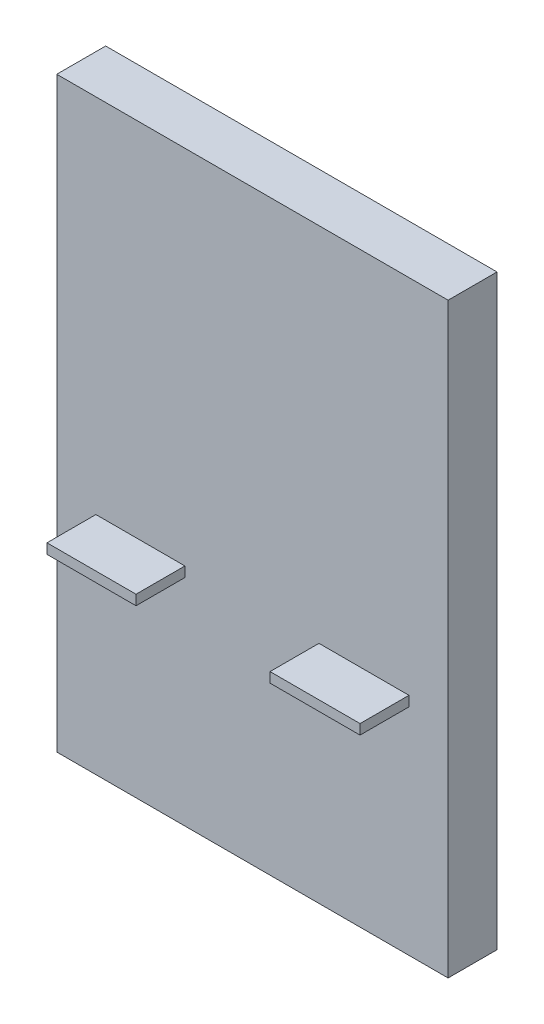
ISO-10303-21;
HEADER;
FILE_DESCRIPTION(('STEP AP214'),'2;1');
FILE_NAME('part.step','',(''),(''),'','','');
FILE_SCHEMA(('AUTOMOTIVE_DESIGN { 1 0 10303 214 1 1 1 1 }'));
ENDSEC;
DATA;
#1=APPLICATION_CONTEXT('core data for automotive mechanical design processes');
#2=APPLICATION_PROTOCOL_DEFINITION('international standard','automotive_design',2000,#1);
#3=PRODUCT_CONTEXT('',#1,'mechanical');
#4=PRODUCT('Part','Part','',(#3));
#5=PRODUCT_RELATED_PRODUCT_CATEGORY('part','',(#4));
#6=PRODUCT_DEFINITION_FORMATION('','',#4);
#7=PRODUCT_DEFINITION_CONTEXT('part definition',#1,'design');
#8=PRODUCT_DEFINITION('design','',#6,#7);
#9=PRODUCT_DEFINITION_SHAPE('','',#8);
#10=(LENGTH_UNIT() NAMED_UNIT(*) SI_UNIT(.MILLI.,.METRE.));
#11=(NAMED_UNIT(*) PLANE_ANGLE_UNIT() SI_UNIT($,.RADIAN.));
#12=(NAMED_UNIT(*) SI_UNIT($,.STERADIAN.) SOLID_ANGLE_UNIT());
#13=UNCERTAINTY_MEASURE_WITH_UNIT(LENGTH_MEASURE(1.E-05),#10,'distance_accuracy_value','');
#14=(GEOMETRIC_REPRESENTATION_CONTEXT(3) GLOBAL_UNCERTAINTY_ASSIGNED_CONTEXT((#13)) GLOBAL_UNIT_ASSIGNED_CONTEXT((#10,
#11,#12)) REPRESENTATION_CONTEXT('',''));
#15=CARTESIAN_POINT('',(0.,0.,0.));
#16=DIRECTION('',(0.,0.,1.));
#17=DIRECTION('',(1.,0.,0.));
#18=AXIS2_PLACEMENT_3D('',#15,#16,#17);
#19=CARTESIAN_POINT('',(0.,0.,0.));
#20=DIRECTION('',(0.,0.,-1.));
#21=DIRECTION('',(-1.,0.,0.));
#22=AXIS2_PLACEMENT_3D('',#19,#20,#21);
#23=PLANE('',#22);
#24=DIRECTION('',(0.,-1.,0.));
#25=VECTOR('',#24,1.);
#26=CARTESIAN_POINT('',(-0.8,1.1,0.));
#27=LINE('',#26,#25);
#28=CARTESIAN_POINT('',(-0.8,1.15119353143523,0.));
#29=VERTEX_POINT('',#28);
#30=CARTESIAN_POINT('',(-0.8,1.1,0.));
#31=VERTEX_POINT('',#30);
#32=EDGE_CURVE('E154',#29,#31,#27,.T.);
#33=ORIENTED_EDGE('',*,*,#32,.F.);
#34=DIRECTION('',(-1.,0.,0.));
#35=VECTOR('',#34,1.);
#36=CARTESIAN_POINT('',(-0.8,1.15119353143523,0.));
#37=LINE('',#36,#35);
#38=CARTESIAN_POINT('',(-0.344987373897849,1.15119353143523,0.));
#39=VERTEX_POINT('',#38);
#40=EDGE_CURVE('E170',#39,#29,#37,.T.);
#41=ORIENTED_EDGE('',*,*,#40,.F.);
#42=DIRECTION('',(0.,1.,0.));
#43=VECTOR('',#42,1.);
#44=CARTESIAN_POINT('',(-0.344987373897849,1.1,0.));
#45=LINE('',#44,#43);
#46=CARTESIAN_POINT('',(-0.344987373897849,1.1,0.));
#47=VERTEX_POINT('',#46);
#48=EDGE_CURVE('E183',#47,#39,#45,.T.);
#49=ORIENTED_EDGE('',*,*,#48,.F.);
#50=DIRECTION('',(1.,0.,0.));
#51=VECTOR('',#50,1.);
#52=CARTESIAN_POINT('',(-0.8,1.1,0.));
#53=LINE('',#52,#51);
#54=EDGE_CURVE('E159',#31,#47,#53,.T.);
#55=ORIENTED_EDGE('',*,*,#54,.F.);
#56=EDGE_LOOP('',(#33,#41,#49,#55));
#57=FACE_BOUND('',#56,.T.);
#58=DIRECTION('',(0.,-1.,0.));
#59=VECTOR('',#58,1.);
#60=CARTESIAN_POINT('',(-1.,0.,0.));
#61=LINE('',#60,#59);
#62=CARTESIAN_POINT('',(-1.,3.,0.));
#63=VERTEX_POINT('',#62);
#64=CARTESIAN_POINT('',(-1.,0.,0.));
#65=VERTEX_POINT('',#64);
#66=EDGE_CURVE('E205',#63,#65,#61,.T.);
#67=ORIENTED_EDGE('',*,*,#66,.T.);
#68=DIRECTION('',(1.,0.,0.));
#69=VECTOR('',#68,1.);
#70=CARTESIAN_POINT('',(-1.,0.,0.));
#71=LINE('',#70,#69);
#72=CARTESIAN_POINT('',(1.,0.,0.));
#73=VERTEX_POINT('',#72);
#74=EDGE_CURVE('E226',#65,#73,#71,.T.);
#75=ORIENTED_EDGE('',*,*,#74,.T.);
#76=DIRECTION('',(0.,1.,0.));
#77=VECTOR('',#76,1.);
#78=CARTESIAN_POINT('',(1.,0.,0.));
#79=LINE('',#78,#77);
#80=CARTESIAN_POINT('',(1.,3.,0.));
#81=VERTEX_POINT('',#80);
#82=EDGE_CURVE('E230',#73,#81,#79,.T.);
#83=ORIENTED_EDGE('',*,*,#82,.T.);
#84=DIRECTION('',(-1.,0.,0.));
#85=VECTOR('',#84,1.);
#86=CARTESIAN_POINT('',(-1.,3.,0.));
#87=LINE('',#86,#85);
#88=EDGE_CURVE('E211',#81,#63,#87,.T.);
#89=ORIENTED_EDGE('',*,*,#88,.T.);
#90=EDGE_LOOP('',(#67,#75,#83,#89));
#91=FACE_BOUND('',#90,.T.);
#92=DIRECTION('',(0.,-1.,0.));
#93=VECTOR('',#92,1.);
#94=CARTESIAN_POINT('',(0.34,1.15119353143523,0.));
#95=LINE('',#94,#93);
#96=CARTESIAN_POINT('',(0.34,1.15119353143523,0.));
#97=VERTEX_POINT('',#96);
#98=CARTESIAN_POINT('',(0.34,1.1,0.));
#99=VERTEX_POINT('',#98);
#100=EDGE_CURVE('E152',#97,#99,#95,.T.);
#101=ORIENTED_EDGE('',*,*,#100,.F.);
#102=DIRECTION('',(-1.,0.,0.));
#103=VECTOR('',#102,1.);
#104=CARTESIAN_POINT('',(0.34,1.15119353143523,0.));
#105=LINE('',#104,#103);
#106=CARTESIAN_POINT('',(0.8,1.15119353143523,0.));
#107=VERTEX_POINT('',#106);
#108=EDGE_CURVE('E149',#107,#97,#105,.T.);
#109=ORIENTED_EDGE('',*,*,#108,.F.);
#110=DIRECTION('',(0.,1.,0.));
#111=VECTOR('',#110,1.);
#112=CARTESIAN_POINT('',(0.8,1.15119353143523,0.));
#113=LINE('',#112,#111);
#114=CARTESIAN_POINT('',(0.8,1.1,0.));
#115=VERTEX_POINT('',#114);
#116=EDGE_CURVE('E62',#115,#107,#113,.T.);
#117=ORIENTED_EDGE('',*,*,#116,.F.);
#118=DIRECTION('',(1.,0.,0.));
#119=VECTOR('',#118,1.);
#120=CARTESIAN_POINT('',(0.34,1.1,0.));
#121=LINE('',#120,#119);
#122=EDGE_CURVE('E57',#99,#115,#121,.T.);
#123=ORIENTED_EDGE('',*,*,#122,.F.);
#124=EDGE_LOOP('',(#101,#109,#117,#123));
#125=FACE_BOUND('',#124,.T.);
#126=ADVANCED_FACE('F39',(#57,#91,#125),#23,.F.);
#127=CARTESIAN_POINT('',(-1.,0.,-0.25));
#128=DIRECTION('',(-1.,0.,0.));
#129=DIRECTION('',(0.,0.,1.));
#130=AXIS2_PLACEMENT_3D('',#127,#128,#129);
#131=PLANE('',#130);
#132=ORIENTED_EDGE('',*,*,#66,.F.);
#133=DIRECTION('',(0.,0.,1.));
#134=VECTOR('',#133,1.);
#135=CARTESIAN_POINT('',(-1.,3.,-0.25));
#136=LINE('',#135,#134);
#137=CARTESIAN_POINT('',(-1.,3.,-0.25));
#138=VERTEX_POINT('',#137);
#139=EDGE_CURVE('E11',#138,#63,#136,.T.);
#140=ORIENTED_EDGE('',*,*,#139,.F.);
#141=DIRECTION('',(0.,-1.,0.));
#142=VECTOR('',#141,1.);
#143=CARTESIAN_POINT('',(-1.,0.,-0.25));
#144=LINE('',#143,#142);
#145=CARTESIAN_POINT('',(-1.,0.,-0.25));
#146=VERTEX_POINT('',#145);
#147=EDGE_CURVE('E206',#138,#146,#144,.T.);
#148=ORIENTED_EDGE('',*,*,#147,.T.);
#149=DIRECTION('',(0.,0.,1.));
#150=VECTOR('',#149,1.);
#151=CARTESIAN_POINT('',(-1.,0.,-0.25));
#152=LINE('',#151,#150);
#153=EDGE_CURVE('E43',#146,#65,#152,.T.);
#154=ORIENTED_EDGE('',*,*,#153,.T.);
#155=EDGE_LOOP('',(#132,#140,#148,#154));
#156=FACE_BOUND('',#155,.T.);
#157=ADVANCED_FACE('F41',(#156),#131,.T.);
#158=CARTESIAN_POINT('',(-1.,3.,-0.25));
#159=DIRECTION('',(0.,1.,0.));
#160=DIRECTION('',(0.,0.,1.));
#161=AXIS2_PLACEMENT_3D('',#158,#159,#160);
#162=PLANE('',#161);
#163=ORIENTED_EDGE('',*,*,#88,.F.);
#164=DIRECTION('',(0.,0.,1.));
#165=VECTOR('',#164,1.);
#166=CARTESIAN_POINT('',(1.,3.,-0.25));
#167=LINE('',#166,#165);
#168=CARTESIAN_POINT('',(1.,3.,-0.25));
#169=VERTEX_POINT('',#168);
#170=EDGE_CURVE('E49',#169,#81,#167,.T.);
#171=ORIENTED_EDGE('',*,*,#170,.F.);
#172=DIRECTION('',(-1.,0.,0.));
#173=VECTOR('',#172,1.);
#174=CARTESIAN_POINT('',(-1.,3.,-0.25));
#175=LINE('',#174,#173);
#176=EDGE_CURVE('E219',#169,#138,#175,.T.);
#177=ORIENTED_EDGE('',*,*,#176,.T.);
#178=ORIENTED_EDGE('',*,*,#139,.T.);
#179=EDGE_LOOP('',(#163,#171,#177,#178));
#180=FACE_BOUND('',#179,.T.);
#181=ADVANCED_FACE('F252',(#180),#162,.T.);
#182=CARTESIAN_POINT('',(1.,0.,-0.25));
#183=DIRECTION('',(1.,0.,0.));
#184=DIRECTION('',(0.,0.,-1.));
#185=AXIS2_PLACEMENT_3D('',#182,#183,#184);
#186=PLANE('',#185);
#187=ORIENTED_EDGE('',*,*,#82,.F.);
#188=DIRECTION('',(0.,0.,1.));
#189=VECTOR('',#188,1.);
#190=CARTESIAN_POINT('',(1.,0.,-0.25));
#191=LINE('',#190,#189);
#192=CARTESIAN_POINT('',(1.,0.,-0.25));
#193=VERTEX_POINT('',#192);
#194=EDGE_CURVE('E238',#193,#73,#191,.T.);
#195=ORIENTED_EDGE('',*,*,#194,.F.);
#196=DIRECTION('',(0.,1.,0.));
#197=VECTOR('',#196,1.);
#198=CARTESIAN_POINT('',(1.,0.,-0.25));
#199=LINE('',#198,#197);
#200=EDGE_CURVE('E215',#193,#169,#199,.T.);
#201=ORIENTED_EDGE('',*,*,#200,.T.);
#202=ORIENTED_EDGE('',*,*,#170,.T.);
#203=EDGE_LOOP('',(#187,#195,#201,#202));
#204=FACE_BOUND('',#203,.T.);
#205=ADVANCED_FACE('F258',(#204),#186,.T.);
#206=CARTESIAN_POINT('',(-1.,0.,-0.25));
#207=DIRECTION('',(0.,-1.,0.));
#208=DIRECTION('',(0.,0.,-1.));
#209=AXIS2_PLACEMENT_3D('',#206,#207,#208);
#210=PLANE('',#209);
#211=ORIENTED_EDGE('',*,*,#74,.F.);
#212=ORIENTED_EDGE('',*,*,#153,.F.);
#213=DIRECTION('',(1.,0.,0.));
#214=VECTOR('',#213,1.);
#215=CARTESIAN_POINT('',(-1.,0.,-0.25));
#216=LINE('',#215,#214);
#217=EDGE_CURVE('E210',#146,#193,#216,.T.);
#218=ORIENTED_EDGE('',*,*,#217,.T.);
#219=ORIENTED_EDGE('',*,*,#194,.T.);
#220=EDGE_LOOP('',(#211,#212,#218,#219));
#221=FACE_BOUND('',#220,.T.);
#222=ADVANCED_FACE('F248',(#221),#210,.T.);
#223=CARTESIAN_POINT('',(0.,0.,-0.25));
#224=DIRECTION('',(0.,0.,-1.));
#225=DIRECTION('',(-1.,0.,0.));
#226=AXIS2_PLACEMENT_3D('',#223,#224,#225);
#227=PLANE('',#226);
#228=ORIENTED_EDGE('',*,*,#147,.F.);
#229=ORIENTED_EDGE('',*,*,#176,.F.);
#230=ORIENTED_EDGE('',*,*,#200,.F.);
#231=ORIENTED_EDGE('',*,*,#217,.F.);
#232=EDGE_LOOP('',(#228,#229,#230,#231));
#233=FACE_BOUND('',#232,.T.);
#234=ADVANCED_FACE('F255',(#233),#227,.T.);
#235=CARTESIAN_POINT('',(-0.8,1.1,0.25));
#236=DIRECTION('',(1.,0.,0.));
#237=DIRECTION('',(0.,0.,-1.));
#238=AXIS2_PLACEMENT_3D('',#235,#236,#237);
#239=PLANE('',#238);
#240=ORIENTED_EDGE('',*,*,#32,.T.);
#241=DIRECTION('',(0.,0.,-1.));
#242=VECTOR('',#241,1.);
#243=CARTESIAN_POINT('',(-0.8,1.1,0.25));
#244=LINE('',#243,#242);
#245=CARTESIAN_POINT('',(-0.8,1.1,0.25));
#246=VERTEX_POINT('',#245);
#247=EDGE_CURVE('E201',#246,#31,#244,.T.);
#248=ORIENTED_EDGE('',*,*,#247,.F.);
#249=DIRECTION('',(0.,-1.,0.));
#250=VECTOR('',#249,1.);
#251=CARTESIAN_POINT('',(-0.8,1.1,0.25));
#252=LINE('',#251,#250);
#253=CARTESIAN_POINT('',(-0.8,1.15119353143523,0.25));
#254=VERTEX_POINT('',#253);
#255=EDGE_CURVE('E165',#254,#246,#252,.T.);
#256=ORIENTED_EDGE('',*,*,#255,.F.);
#257=DIRECTION('',(0.,0.,-1.));
#258=VECTOR('',#257,1.);
#259=CARTESIAN_POINT('',(-0.8,1.15119353143523,0.25));
#260=LINE('',#259,#258);
#261=EDGE_CURVE('E178',#254,#29,#260,.T.);
#262=ORIENTED_EDGE('',*,*,#261,.T.);
#263=EDGE_LOOP('',(#240,#248,#256,#262));
#264=FACE_BOUND('',#263,.T.);
#265=ADVANCED_FACE('F275',(#264),#239,.F.);
#266=CARTESIAN_POINT('',(-0.8,1.1,0.25));
#267=DIRECTION('',(0.,1.,0.));
#268=DIRECTION('',(0.,0.,1.));
#269=AXIS2_PLACEMENT_3D('',#266,#267,#268);
#270=PLANE('',#269);
#271=ORIENTED_EDGE('',*,*,#54,.T.);
#272=DIRECTION('',(0.,0.,-1.));
#273=VECTOR('',#272,1.);
#274=CARTESIAN_POINT('',(-0.344987373897849,1.1,0.25));
#275=LINE('',#274,#273);
#276=CARTESIAN_POINT('',(-0.344987373897849,1.1,0.25));
#277=VERTEX_POINT('',#276);
#278=EDGE_CURVE('E197',#277,#47,#275,.T.);
#279=ORIENTED_EDGE('',*,*,#278,.F.);
#280=DIRECTION('',(1.,0.,0.));
#281=VECTOR('',#280,1.);
#282=CARTESIAN_POINT('',(-0.8,1.1,0.25));
#283=LINE('',#282,#281);
#284=EDGE_CURVE('E169',#246,#277,#283,.T.);
#285=ORIENTED_EDGE('',*,*,#284,.F.);
#286=ORIENTED_EDGE('',*,*,#247,.T.);
#287=EDGE_LOOP('',(#271,#279,#285,#286));
#288=FACE_BOUND('',#287,.T.);
#289=ADVANCED_FACE('F278',(#288),#270,.F.);
#290=CARTESIAN_POINT('',(-0.344987373897849,1.1,0.25));
#291=DIRECTION('',(-1.,0.,0.));
#292=DIRECTION('',(0.,0.,1.));
#293=AXIS2_PLACEMENT_3D('',#290,#291,#292);
#294=PLANE('',#293);
#295=ORIENTED_EDGE('',*,*,#48,.T.);
#296=DIRECTION('',(0.,0.,-1.));
#297=VECTOR('',#296,1.);
#298=CARTESIAN_POINT('',(-0.344987373897849,1.15119353143523,0.25));
#299=LINE('',#298,#297);
#300=CARTESIAN_POINT('',(-0.344987373897849,1.15119353143523,0.25));
#301=VERTEX_POINT('',#300);
#302=EDGE_CURVE('E193',#301,#39,#299,.T.);
#303=ORIENTED_EDGE('',*,*,#302,.F.);
#304=DIRECTION('',(0.,1.,0.));
#305=VECTOR('',#304,1.);
#306=CARTESIAN_POINT('',(-0.344987373897849,1.1,0.25));
#307=LINE('',#306,#305);
#308=EDGE_CURVE('E173',#277,#301,#307,.T.);
#309=ORIENTED_EDGE('',*,*,#308,.F.);
#310=ORIENTED_EDGE('',*,*,#278,.T.);
#311=EDGE_LOOP('',(#295,#303,#309,#310));
#312=FACE_BOUND('',#311,.T.);
#313=ADVANCED_FACE('F282',(#312),#294,.F.);
#314=CARTESIAN_POINT('',(-0.8,1.15119353143523,0.25));
#315=DIRECTION('',(0.,-1.,0.));
#316=DIRECTION('',(0.,0.,-1.));
#317=AXIS2_PLACEMENT_3D('',#314,#315,#316);
#318=PLANE('',#317);
#319=ORIENTED_EDGE('',*,*,#40,.T.);
#320=ORIENTED_EDGE('',*,*,#261,.F.);
#321=DIRECTION('',(-1.,0.,0.));
#322=VECTOR('',#321,1.);
#323=CARTESIAN_POINT('',(-0.8,1.15119353143523,0.25));
#324=LINE('',#323,#322);
#325=EDGE_CURVE('E176',#301,#254,#324,.T.);
#326=ORIENTED_EDGE('',*,*,#325,.F.);
#327=ORIENTED_EDGE('',*,*,#302,.T.);
#328=EDGE_LOOP('',(#319,#320,#326,#327));
#329=FACE_BOUND('',#328,.T.);
#330=ADVANCED_FACE('F286',(#329),#318,.F.);
#331=CARTESIAN_POINT('',(0.,0.,0.25));
#332=DIRECTION('',(0.,0.,-1.));
#333=DIRECTION('',(-1.,0.,0.));
#334=AXIS2_PLACEMENT_3D('',#331,#332,#333);
#335=PLANE('',#334);
#336=ORIENTED_EDGE('',*,*,#255,.T.);
#337=ORIENTED_EDGE('',*,*,#284,.T.);
#338=ORIENTED_EDGE('',*,*,#308,.T.);
#339=ORIENTED_EDGE('',*,*,#325,.T.);
#340=EDGE_LOOP('',(#336,#337,#338,#339));
#341=FACE_BOUND('',#340,.T.);
#342=ADVANCED_FACE('F290',(#341),#335,.F.);
#343=CARTESIAN_POINT('',(0.34,1.15119353143523,0.25));
#344=DIRECTION('',(1.,0.,0.));
#345=DIRECTION('',(0.,0.,-1.));
#346=AXIS2_PLACEMENT_3D('',#343,#344,#345);
#347=PLANE('',#346);
#348=ORIENTED_EDGE('',*,*,#100,.T.);
#349=DIRECTION('',(0.,0.,-1.));
#350=VECTOR('',#349,1.);
#351=CARTESIAN_POINT('',(0.34,1.1,0.25));
#352=LINE('',#351,#350);
#353=CARTESIAN_POINT('',(0.34,1.1,0.25));
#354=VERTEX_POINT('',#353);
#355=EDGE_CURVE('E131',#354,#99,#352,.T.);
#356=ORIENTED_EDGE('',*,*,#355,.F.);
#357=DIRECTION('',(0.,-1.,0.));
#358=VECTOR('',#357,1.);
#359=CARTESIAN_POINT('',(0.34,1.15119353143523,0.25));
#360=LINE('',#359,#358);
#361=CARTESIAN_POINT('',(0.34,1.15119353143523,0.25));
#362=VERTEX_POINT('',#361);
#363=EDGE_CURVE('E139',#362,#354,#360,.T.);
#364=ORIENTED_EDGE('',*,*,#363,.F.);
#365=DIRECTION('',(0.,0.,-1.));
#366=VECTOR('',#365,1.);
#367=CARTESIAN_POINT('',(0.34,1.15119353143523,0.25));
#368=LINE('',#367,#366);
#369=EDGE_CURVE('E402',#362,#97,#368,.T.);
#370=ORIENTED_EDGE('',*,*,#369,.T.);
#371=EDGE_LOOP('',(#348,#356,#364,#370));
#372=FACE_BOUND('',#371,.T.);
#373=ADVANCED_FACE('F151',(#372),#347,.F.);
#374=CARTESIAN_POINT('',(0.34,1.1,0.25));
#375=DIRECTION('',(0.,1.,0.));
#376=DIRECTION('',(0.,0.,1.));
#377=AXIS2_PLACEMENT_3D('',#374,#375,#376);
#378=PLANE('',#377);
#379=ORIENTED_EDGE('',*,*,#122,.T.);
#380=DIRECTION('',(0.,0.,-1.));
#381=VECTOR('',#380,1.);
#382=CARTESIAN_POINT('',(0.8,1.1,0.25));
#383=LINE('',#382,#381);
#384=CARTESIAN_POINT('',(0.8,1.1,0.25));
#385=VERTEX_POINT('',#384);
#386=EDGE_CURVE('E134',#385,#115,#383,.T.);
#387=ORIENTED_EDGE('',*,*,#386,.F.);
#388=DIRECTION('',(1.,0.,0.));
#389=VECTOR('',#388,1.);
#390=CARTESIAN_POINT('',(0.34,1.1,0.25));
#391=LINE('',#390,#389);
#392=EDGE_CURVE('E127',#354,#385,#391,.T.);
#393=ORIENTED_EDGE('',*,*,#392,.F.);
#394=ORIENTED_EDGE('',*,*,#355,.T.);
#395=EDGE_LOOP('',(#379,#387,#393,#394));
#396=FACE_BOUND('',#395,.T.);
#397=ADVANCED_FACE('F129',(#396),#378,.F.);
#398=CARTESIAN_POINT('',(0.8,1.15119353143523,0.25));
#399=DIRECTION('',(-1.,0.,0.));
#400=DIRECTION('',(0.,-1.,0.));
#401=AXIS2_PLACEMENT_3D('',#398,#399,#400);
#402=PLANE('',#401);
#403=ORIENTED_EDGE('',*,*,#116,.T.);
#404=DIRECTION('',(0.,0.,-1.));
#405=VECTOR('',#404,1.);
#406=CARTESIAN_POINT('',(0.8,1.15119353143523,0.25));
#407=LINE('',#406,#405);
#408=CARTESIAN_POINT('',(0.8,1.15119353143523,0.25));
#409=VERTEX_POINT('',#408);
#410=EDGE_CURVE('E161',#409,#107,#407,.T.);
#411=ORIENTED_EDGE('',*,*,#410,.F.);
#412=DIRECTION('',(0.,1.,0.));
#413=VECTOR('',#412,1.);
#414=CARTESIAN_POINT('',(0.8,1.15119353143523,0.25));
#415=LINE('',#414,#413);
#416=EDGE_CURVE('E138',#385,#409,#415,.T.);
#417=ORIENTED_EDGE('',*,*,#416,.F.);
#418=ORIENTED_EDGE('',*,*,#386,.T.);
#419=EDGE_LOOP('',(#403,#411,#417,#418));
#420=FACE_BOUND('',#419,.T.);
#421=ADVANCED_FACE('F299',(#420),#402,.F.);
#422=CARTESIAN_POINT('',(0.34,1.15119353143523,0.25));
#423=DIRECTION('',(0.,-1.,0.));
#424=DIRECTION('',(0.,0.,-1.));
#425=AXIS2_PLACEMENT_3D('',#422,#423,#424);
#426=PLANE('',#425);
#427=ORIENTED_EDGE('',*,*,#108,.T.);
#428=ORIENTED_EDGE('',*,*,#369,.F.);
#429=DIRECTION('',(-1.,0.,0.));
#430=VECTOR('',#429,1.);
#431=CARTESIAN_POINT('',(0.34,1.15119353143523,0.25));
#432=LINE('',#431,#430);
#433=EDGE_CURVE('E144',#409,#362,#432,.T.);
#434=ORIENTED_EDGE('',*,*,#433,.F.);
#435=ORIENTED_EDGE('',*,*,#410,.T.);
#436=EDGE_LOOP('',(#427,#428,#434,#435));
#437=FACE_BOUND('',#436,.T.);
#438=ADVANCED_FACE('F302',(#437),#426,.F.);
#439=CARTESIAN_POINT('',(0.,0.,0.25));
#440=DIRECTION('',(0.,0.,1.));
#441=DIRECTION('',(1.,0.,0.));
#442=AXIS2_PLACEMENT_3D('',#439,#440,#441);
#443=PLANE('',#442);
#444=ORIENTED_EDGE('',*,*,#363,.T.);
#445=ORIENTED_EDGE('',*,*,#392,.T.);
#446=ORIENTED_EDGE('',*,*,#416,.T.);
#447=ORIENTED_EDGE('',*,*,#433,.T.);
#448=EDGE_LOOP('',(#444,#445,#446,#447));
#449=FACE_BOUND('',#448,.T.);
#450=ADVANCED_FACE('F142',(#449),#443,.T.);
#451=CLOSED_SHELL('',(#126,#157,#181,#205,#222,#234,#265,#289,#313,#330,#342,#373,#397,#421,
#438,#450));
#452=MANIFOLD_SOLID_BREP('B2',#451);
#453=ADVANCED_BREP_SHAPE_REPRESENTATION('',(#18,#452),#14);
#454=SHAPE_DEFINITION_REPRESENTATION(#9,#453);
ENDSEC;
END-ISO-10303-21;
